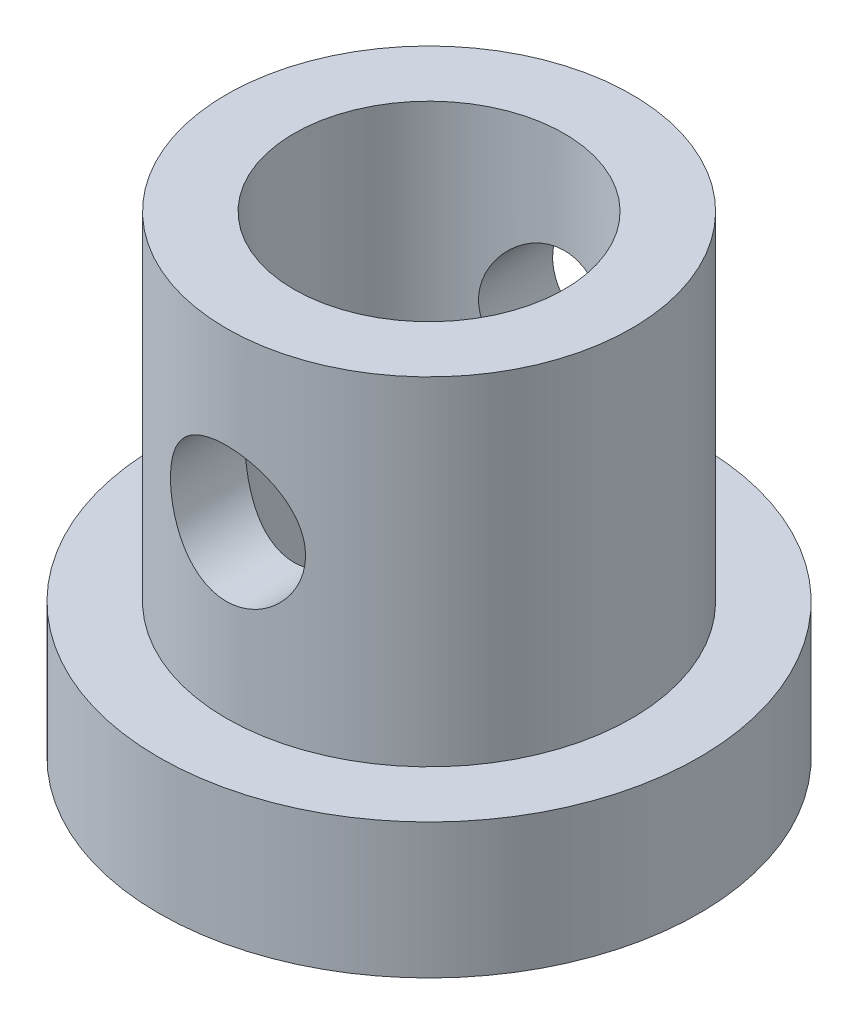
ISO-10303-21;
HEADER;
FILE_DESCRIPTION(('STEP AP214'),'2;1');
FILE_NAME('part.step','',(''),(''),'','','');
FILE_SCHEMA(('AUTOMOTIVE_DESIGN { 1 0 10303 214 1 1 1 1 }'));
ENDSEC;
DATA;
#1=APPLICATION_CONTEXT('core data for automotive mechanical design processes');
#2=APPLICATION_PROTOCOL_DEFINITION('international standard','automotive_design',2000,#1);
#3=PRODUCT_CONTEXT('',#1,'mechanical');
#4=PRODUCT('Part','Part','',(#3));
#5=PRODUCT_RELATED_PRODUCT_CATEGORY('part','',(#4));
#6=PRODUCT_DEFINITION_FORMATION('','',#4);
#7=PRODUCT_DEFINITION_CONTEXT('part definition',#1,'design');
#8=PRODUCT_DEFINITION('design','',#6,#7);
#9=PRODUCT_DEFINITION_SHAPE('','',#8);
#10=(LENGTH_UNIT() NAMED_UNIT(*) SI_UNIT(.MILLI.,.METRE.));
#11=(NAMED_UNIT(*) PLANE_ANGLE_UNIT() SI_UNIT($,.RADIAN.));
#12=(NAMED_UNIT(*) SI_UNIT($,.STERADIAN.) SOLID_ANGLE_UNIT());
#13=UNCERTAINTY_MEASURE_WITH_UNIT(LENGTH_MEASURE(1.E-05),#10,'distance_accuracy_value','');
#14=(GEOMETRIC_REPRESENTATION_CONTEXT(3) GLOBAL_UNCERTAINTY_ASSIGNED_CONTEXT((#13)) GLOBAL_UNIT_ASSIGNED_CONTEXT((#10,
#11,#12)) REPRESENTATION_CONTEXT('',''));
#15=CARTESIAN_POINT('',(0.,0.,0.));
#16=DIRECTION('',(0.,0.,1.));
#17=DIRECTION('',(1.,0.,0.));
#18=AXIS2_PLACEMENT_3D('',#15,#16,#17);
#19=CARTESIAN_POINT('',(0.,2.,0.));
#20=DIRECTION('',(0.,1.,0.));
#21=DIRECTION('',(0.,0.,1.));
#22=AXIS2_PLACEMENT_3D('',#19,#20,#21);
#23=PLANE('',#22);
#24=CARTESIAN_POINT('',(0.,2.,0.));
#25=DIRECTION('',(0.,1.,0.));
#26=DIRECTION('',(0.,0.,1.));
#27=AXIS2_PLACEMENT_3D('',#24,#25,#26);
#28=CIRCLE('',#27,4.);
#29=CARTESIAN_POINT('',(0.,2.,4.));
#30=VERTEX_POINT('',#29);
#31=EDGE_CURVE('E10',#30,#30,#28,.T.);
#32=ORIENTED_EDGE('',*,*,#31,.T.);
#33=EDGE_LOOP('',(#32));
#34=FACE_BOUND('',#33,.T.);
#35=CARTESIAN_POINT('',(0.,2.,0.));
#36=DIRECTION('',(0.,1.,0.));
#37=DIRECTION('',(0.,0.,1.));
#38=AXIS2_PLACEMENT_3D('',#35,#36,#37);
#39=CIRCLE('',#38,3.);
#40=CARTESIAN_POINT('',(0.,2.,3.));
#41=VERTEX_POINT('',#40);
#42=EDGE_CURVE('E104',#41,#41,#39,.T.);
#43=ORIENTED_EDGE('',*,*,#42,.F.);
#44=EDGE_LOOP('',(#43));
#45=FACE_BOUND('',#44,.T.);
#46=ADVANCED_FACE('F31',(#34,#45),#23,.T.);
#47=CARTESIAN_POINT('',(0.,0.,0.));
#48=DIRECTION('',(0.,1.,0.));
#49=DIRECTION('',(0.,0.,1.));
#50=AXIS2_PLACEMENT_3D('',#47,#48,#49);
#51=PLANE('',#50);
#52=CARTESIAN_POINT('',(0.,0.,0.));
#53=DIRECTION('',(0.,1.,0.));
#54=DIRECTION('',(0.,0.,1.));
#55=AXIS2_PLACEMENT_3D('',#52,#53,#54);
#56=CIRCLE('',#55,4.);
#57=CARTESIAN_POINT('',(0.,0.,4.));
#58=VERTEX_POINT('',#57);
#59=EDGE_CURVE('E44',#58,#58,#56,.T.);
#60=ORIENTED_EDGE('',*,*,#59,.F.);
#61=EDGE_LOOP('',(#60));
#62=FACE_BOUND('',#61,.T.);
#63=CARTESIAN_POINT('',(0.,0.,0.));
#64=DIRECTION('',(0.,1.,0.));
#65=DIRECTION('',(0.,0.,1.));
#66=AXIS2_PLACEMENT_3D('',#63,#64,#65);
#67=CIRCLE('',#66,2.);
#68=CARTESIAN_POINT('',(0.,0.,2.));
#69=VERTEX_POINT('',#68);
#70=EDGE_CURVE('E49',#69,#69,#67,.T.);
#71=ORIENTED_EDGE('',*,*,#70,.T.);
#72=EDGE_LOOP('',(#71));
#73=FACE_BOUND('',#72,.T.);
#74=ADVANCED_FACE('F90',(#62,#73),#51,.F.);
#75=CARTESIAN_POINT('',(0.,2.,0.));
#76=DIRECTION('',(0.,-1.,0.));
#77=DIRECTION('',(0.,0.,-1.));
#78=AXIS2_PLACEMENT_3D('',#75,#76,#77);
#79=CYLINDRICAL_SURFACE('',#78,4.);
#80=ORIENTED_EDGE('',*,*,#31,.F.);
#81=EDGE_LOOP('',(#80));
#82=FACE_BOUND('',#81,.T.);
#83=ORIENTED_EDGE('',*,*,#59,.T.);
#84=EDGE_LOOP('',(#83));
#85=FACE_BOUND('',#84,.T.);
#86=ADVANCED_FACE('F33',(#82,#85),#79,.T.);
#87=CARTESIAN_POINT('',(0.,2.,0.));
#88=DIRECTION('',(0.,-1.,0.));
#89=DIRECTION('',(0.,0.,-1.));
#90=AXIS2_PLACEMENT_3D('',#87,#88,#89);
#91=CYLINDRICAL_SURFACE('',#90,2.);
#92=CARTESIAN_POINT('',(0.,5.5,-2.));
#93=CARTESIAN_POINT('',(-0.0525719629529865,5.4999966976805,-1.99999713404151));
#94=CARTESIAN_POINT('',(-0.105206599698033,5.49582992687833,-1.99790491019518));
#95=CARTESIAN_POINT('',(-0.208920235268425,5.47934711965908,-1.98974156037396));
#96=CARTESIAN_POINT('',(-0.259996086713504,5.46701560700235,-1.98366287828984));
#97=CARTESIAN_POINT('',(-0.358933544880574,5.43480619138321,-1.96816279403312));
#98=CARTESIAN_POINT('',(-0.40680680293918,5.41495761575199,-1.9587543917752));
#99=CARTESIAN_POINT('',(-0.498472616806565,5.36842937863506,-1.93745776515779));
#100=CARTESIAN_POINT('',(-0.54226549399005,5.34175025575115,-1.9255697363353));
#101=CARTESIAN_POINT('',(-0.627507817761919,5.2804827505147,-1.89956258258057));
#102=CARTESIAN_POINT('',(-0.668655211122112,5.24551352076036,-1.88535199127536));
#103=CARTESIAN_POINT('',(-0.744779444866977,5.16947852075297,-1.85659970246744));
#104=CARTESIAN_POINT('',(-0.779751583106766,5.12840814822756,-1.84205776209035));
#105=CARTESIAN_POINT('',(-0.845252000450278,5.03751665047662,-1.81298951197347));
#106=CARTESIAN_POINT('',(-0.875225335551637,4.98726390165409,-1.79855186970132));
#107=CARTESIAN_POINT('',(-0.926168226890695,4.88163266401379,-1.77285978772321));
#108=CARTESIAN_POINT('',(-0.947144214966334,4.82625787127725,-1.7616030760699));
#109=CARTESIAN_POINT('',(-0.978132442188588,4.71533489457808,-1.74457867037809));
#110=CARTESIAN_POINT('',(-0.988725857080441,4.65999554793261,-1.73852271583714));
#111=CARTESIAN_POINT('',(-1.00042699330885,4.54802116222052,-1.73181889948528));
#112=CARTESIAN_POINT('',(-1.00154408837307,4.49138745912885,-1.73116569343288));
#113=CARTESIAN_POINT('',(-0.994687287172294,4.38571397568463,-1.73510930257248));
#114=CARTESIAN_POINT('',(-0.987784559536821,4.33657596877695,-1.73908763662014));
#115=CARTESIAN_POINT('',(-0.966939849056932,4.24027809062696,-1.7507622873385));
#116=CARTESIAN_POINT('',(-0.952995623897652,4.19311885469468,-1.75845978831776));
#117=CARTESIAN_POINT('',(-0.918209780386004,4.10077086743434,-1.77687476412741));
#118=CARTESIAN_POINT('',(-0.897215067115995,4.05565360121421,-1.78765840663999));
#119=CARTESIAN_POINT('',(-0.849041687668002,3.96936570740999,-1.81103404281404));
#120=CARTESIAN_POINT('',(-0.821860243812467,3.92819686439991,-1.82362684780191));
#121=CARTESIAN_POINT('',(-0.758066054912788,3.84547874725677,-1.85113157903286));
#122=CARTESIAN_POINT('',(-0.720694458369281,3.80454312642384,-1.86613510236746));
#123=CARTESIAN_POINT('',(-0.639555578741373,3.7292645814091,-1.89547623300407));
#124=CARTESIAN_POINT('',(-0.595785256574285,3.69492480796612,-1.90981351958801));
#125=CARTESIAN_POINT('',(-0.500516505831848,3.63231433897027,-1.93701987282964));
#126=CARTESIAN_POINT('',(-0.448753591599409,3.60439952755426,-1.94978984162007));
#127=CARTESIAN_POINT('',(-0.340466215488797,3.55790297095699,-1.97157881121242));
#128=CARTESIAN_POINT('',(-0.283945576265277,3.53931381498483,-1.98060078943553));
#129=CARTESIAN_POINT('',(-0.172766491660702,3.51352459628332,-1.99324333741436));
#130=CARTESIAN_POINT('',(-0.118341530548324,3.50550876425322,-1.99724938301312));
#131=CARTESIAN_POINT('',(-0.0087795999493535,3.49853526886551,-2.00073013459102));
#132=CARTESIAN_POINT('',(0.0463570198699014,3.49957331436052,-2.00020698721312));
#133=CARTESIAN_POINT('',(0.151232971985994,3.51020668841875,-1.99491192253441));
#134=CARTESIAN_POINT('',(0.201059408049954,3.51913253273003,-1.9904724568819));
#135=CARTESIAN_POINT('',(0.298406892301917,3.54423807189509,-1.97822171314819));
#136=CARTESIAN_POINT('',(0.345927685690997,3.56041856645336,-1.97041006334332));
#137=CARTESIAN_POINT('',(0.438888608449665,3.59999846643317,-1.95184251413669));
#138=CARTESIAN_POINT('',(0.484230397006154,3.62359105011681,-1.94100881769939));
#139=CARTESIAN_POINT('',(0.570461361698921,3.67710753564604,-1.91743974317109));
#140=CARTESIAN_POINT('',(0.611348629775282,3.70703413459343,-1.90470355565785));
#141=CARTESIAN_POINT('',(0.691767689290653,3.77576042533287,-1.87708221337464));
#142=CARTESIAN_POINT('',(0.730772077824639,3.81514286845357,-1.86210884848441));
#143=CARTESIAN_POINT('',(0.80185632111324,3.89992515126931,-1.83262391603874));
#144=CARTESIAN_POINT('',(0.833931385690841,3.94532911881638,-1.81811267381526));
#145=CARTESIAN_POINT('',(0.891707914497696,4.04364365420031,-1.79051192226068));
#146=CARTESIAN_POINT('',(0.917025495878637,4.09681126620859,-1.77752529663472));
#147=CARTESIAN_POINT('',(0.958082826013803,4.20751006769252,-1.75574072368126));
#148=CARTESIAN_POINT('',(0.97383491588757,4.26503552650119,-1.74693738240618));
#149=CARTESIAN_POINT('',(0.993861687449679,4.37691022286145,-1.73561501008667));
#150=CARTESIAN_POINT('',(0.999092996400865,4.43103425342904,-1.73257383460491));
#151=CARTESIAN_POINT('',(1.00068915438079,4.53944706717073,-1.73165354646175));
#152=CARTESIAN_POINT('',(0.997057846624399,4.59373576873943,-1.73377219627553));
#153=CARTESIAN_POINT('',(0.981926125592263,4.69548350153202,-1.74237862050025));
#154=CARTESIAN_POINT('',(0.9712083143428,4.7431004701444,-1.74843094482394));
#155=CARTESIAN_POINT('',(0.943175358224645,4.83580811942471,-1.76371016187917));
#156=CARTESIAN_POINT('',(0.92585809115981,4.88089798209197,-1.77293807569676));
#157=CARTESIAN_POINT('',(0.883815745300683,4.97062485098661,-1.79428530364528));
#158=CARTESIAN_POINT('',(0.858671137816457,5.0150279018297,-1.80655722396191));
#159=CARTESIAN_POINT('',(0.802150971636633,5.09927453618059,-1.8323533163459));
#160=CARTESIAN_POINT('',(0.770772171238647,5.13911573051849,-1.84587813794522));
#161=CARTESIAN_POINT('',(0.698203326664641,5.21814198235762,-1.87462323159313));
#162=CARTESIAN_POINT('',(0.656284423010171,5.25665910236192,-1.88984983311469));
#163=CARTESIAN_POINT('',(0.56615480622028,5.32626298342363,-1.91877752255088));
#164=CARTESIAN_POINT('',(0.517940723256785,5.35734573942629,-1.9324777860804));
#165=CARTESIAN_POINT('',(0.415931596819947,5.4112363627622,-1.95698009585103));
#166=CARTESIAN_POINT('',(0.362099503934615,5.43398416941144,-1.96776096562909));
#167=CARTESIAN_POINT('',(0.250742101294191,5.46980816791895,-1.98501341363465));
#168=CARTESIAN_POINT('',(0.193227799623166,5.48291184682958,-1.99149723372932));
#169=CARTESIAN_POINT('',(0.112601946483384,5.49389741107585,-1.99695461909663));
#170=CARTESIAN_POINT('',(0.0901618794394986,5.49618264086362,-1.99809365339202));
#171=CARTESIAN_POINT('',(0.0451517318071576,5.49923466551681,-1.99961696977865));
#172=CARTESIAN_POINT('',(0.0225816476473814,5.5000014184712,-2.00000123103763));
#173=CARTESIAN_POINT('',(0.,5.5,-2.));
#174=B_SPLINE_CURVE_WITH_KNOTS('',3,(#92,#93,#94,#95,#96,#97,#98,#99,#100,#101,#102,#103,#104,
#105,#106,#107,#108,#109,#110,#111,#112,#113,#114,#115,#116,#117,#118,#119,#120,#121,#122,#123,
#124,#125,#126,#127,#128,#129,#130,#131,#132,#133,#134,#135,#136,#137,#138,#139,#140,#141,#142,
#143,#144,#145,#146,#147,#148,#149,#150,#151,#152,#153,#154,#155,#156,#157,#158,#159,#160,#161,
#162,#163,#164,#165,#166,#167,#168,#169,#170,#171,#172,#173),.UNSPECIFIED.,.T.,.F.,(4,2,2,2,2,2,
2,2,2,2,2,2,2,2,2,2,2,2,2,2,2,2,2,2,2,2,2,2,2,2,2,2,2,2,2,2,2,2,2,2,4),(0.,0.157624257420293,
0.315548149709198,0.472862155492298,0.630163760581568,0.796981758718089,0.963926237654035,
1.14381726430753,1.32357947898281,1.49258012140229,1.6614135732902,1.81005712409321,
1.95874803925678,2.11090240168487,2.26312521260222,2.43464941333878,2.60625534598686,
2.78583022214441,2.9652621691228,3.12983290471346,3.29432564511476,3.44606906506122,
3.59782921630932,3.75392856027899,3.91009450748339,4.08159610644419,4.25321588615432,
4.43314682159674,4.61284511940778,4.77529307498373,4.93767059860005,5.08457930244183,
5.23153528783678,5.38836456775614,5.54527561138958,5.72125242752498,5.89732383376572,
6.07464013662925,6.2514490862493,6.31915280137697,6.38685838514847),.UNSPECIFIED.);
#175=CARTESIAN_POINT('',(0.,5.5,-2.));
#176=VERTEX_POINT('',#175);
#177=EDGE_CURVE('E78',#176,#176,#174,.T.);
#178=ORIENTED_EDGE('',*,*,#177,.F.);
#179=EDGE_LOOP('',(#178));
#180=FACE_BOUND('',#179,.T.);
#181=CARTESIAN_POINT('',(1.,4.5,1.73205080756888));
#182=CARTESIAN_POINT('',(0.999996363074532,4.44789219180475,1.73205534728459));
#183=CARTESIAN_POINT('',(0.995899970733217,4.39571858847496,1.73443801187756));
#184=CARTESIAN_POINT('',(0.979723209898053,4.29297273532285,1.74362366452052));
#185=CARTESIAN_POINT('',(0.967626064554179,4.24240408495659,1.75043594055559));
#186=CARTESIAN_POINT('',(0.936099948699812,4.14454833565606,1.76749346605398));
#187=CARTESIAN_POINT('',(0.916709952493731,4.09724534752641,1.77772043473252));
#188=CARTESIAN_POINT('',(0.871267525376372,4.00657579800328,1.80042664816858));
#189=CARTESIAN_POINT('',(0.845214734035774,3.96320944973754,1.81290601476065));
#190=CARTESIAN_POINT('',(0.784666540530879,3.87769427144249,1.83996869057441));
#191=CARTESIAN_POINT('',(0.74965203614377,3.83594086432646,1.85464063637954));
#192=CARTESIAN_POINT('',(0.673253807614468,3.75859161159329,1.88371982785706));
#193=CARTESIAN_POINT('',(0.631866925782293,3.72299883741648,1.8981269383125));
#194=CARTESIAN_POINT('',(0.540489563414546,3.65663284885234,1.92621476952949));
#195=CARTESIAN_POINT('',(0.490107189012575,3.62634623214047,1.93978106418172));
#196=CARTESIAN_POINT('',(0.384157026599505,3.57485914675424,1.96350756099529));
#197=CARTESIAN_POINT('',(0.328592538138156,3.55365294386283,1.97366991183742));
#198=CARTESIAN_POINT('',(0.218044943925978,3.5224953386989,1.98880461244237));
#199=CARTESIAN_POINT('',(0.163301790488818,3.51185047364447,1.99409480220892));
#200=CARTESIAN_POINT('',(0.0525706286978487,3.49983388132496,2.00007583846067));
#201=CARTESIAN_POINT('',(-0.00341660584373794,3.49845654320429,2.0007694678459));
#202=CARTESIAN_POINT('',(-0.109832524423749,3.50474667397035,1.9976298191645));
#203=CARTESIAN_POINT('',(-0.160321199176791,3.51163801552122,1.9941849589216));
#204=CARTESIAN_POINT('',(-0.259313771918321,3.53288084390466,1.98374245259747));
#205=CARTESIAN_POINT('',(-0.307817521093925,3.54723288897622,1.97674454066394));
#206=CARTESIAN_POINT('',(-0.402309391569553,3.58308256608981,1.95971583287654));
#207=CARTESIAN_POINT('',(-0.448253423515178,3.60467631317207,1.94964441529199));
#208=CARTESIAN_POINT('',(-0.535976801513328,3.65426341620149,1.92737645986687));
#209=CARTESIAN_POINT('',(-0.577754648838645,3.68225906330235,1.91517916157484));
#210=CARTESIAN_POINT('',(-0.660173660898194,3.74689535153302,1.88844394399229));
#211=CARTESIAN_POINT('',(-0.70033407502936,3.78410302832601,1.87379375998175));
#212=CARTESIAN_POINT('',(-0.77410437029778,3.86458972493018,1.84454340586812));
#213=CARTESIAN_POINT('',(-0.80770921157423,3.90787337227406,1.82994328265629));
#214=CARTESIAN_POINT('',(-0.869505334642211,4.00264819242409,1.80144156092485));
#215=CARTESIAN_POINT('',(-0.897217314978051,4.05448602305421,1.78764319990708));
#216=CARTESIAN_POINT('',(-0.943319113001231,4.162937671359,1.76375450278576));
#217=CARTESIAN_POINT('',(-0.961718658210889,4.21954643301756,1.75366030046067));
#218=CARTESIAN_POINT('',(-0.98718021102504,4.33121451128279,1.73944635817034));
#219=CARTESIAN_POINT('',(-0.995025122119976,4.38604111904355,1.73491655848496));
#220=CARTESIAN_POINT('',(-1.00151694661143,4.49640134151654,1.7311791936161));
#221=CARTESIAN_POINT('',(-1.00017035731503,4.55193442911979,1.73196786889312));
#222=CARTESIAN_POINT('',(-0.989036043343966,4.65565391857873,1.73834336540585));
#223=CARTESIAN_POINT('',(-0.980187816712467,4.70397945110793,1.74339587506654));
#224=CARTESIAN_POINT('',(-0.955696284632441,4.79836778627096,1.75694021551341));
#225=CARTESIAN_POINT('',(-0.940050778623615,4.84442985074661,1.76543316005034));
#226=CARTESIAN_POINT('',(-0.901647588604886,4.9354113309027,1.78536222079657));
#227=CARTESIAN_POINT('',(-0.878594063692724,4.98017901685355,1.79691643243063));
#228=CARTESIAN_POINT('',(-0.826287064015805,5.06546927153899,1.8215611949725));
#229=CARTESIAN_POINT('',(-0.797030404332217,5.10598964351328,1.83465253355148));
#230=CARTESIAN_POINT('',(-0.728837167198854,5.18697876752355,1.86287998456336));
#231=CARTESIAN_POINT('',(-0.689145272314967,5.22679715071766,1.87806583154289));
#232=CARTESIAN_POINT('',(-0.603404495398289,5.29941223799359,1.90734234977892));
#233=CARTESIAN_POINT('',(-0.557353474655348,5.33220657023054,1.92143265007709));
#234=CARTESIAN_POINT('',(-0.458535362558758,5.3905737259501,1.94741361690957));
#235=CARTESIAN_POINT('',(-0.405623097574114,5.41593311821091,1.95923641672029));
#236=CARTESIAN_POINT('',(-0.295522364641082,5.45713790385739,1.97883354959301));
#237=CARTESIAN_POINT('',(-0.238337701392176,5.47299165136631,1.98661143676373));
#238=CARTESIAN_POINT('',(-0.126979682330418,5.49336856417466,1.99667508181883));
#239=CARTESIAN_POINT('',(-0.0730114438504576,5.49879787587611,1.99939927908191));
#240=CARTESIAN_POINT('',(0.035125985951203,5.5008432654544,2.00042130375131));
#241=CARTESIAN_POINT('',(0.0892951002950863,5.49746242852356,1.9987206806689));
#242=CARTESIAN_POINT('',(0.192537992317147,5.48258359320438,1.99133968837923));
#243=CARTESIAN_POINT('',(0.241712317811263,5.47163515074233,1.9859289466799));
#244=CARTESIAN_POINT('',(0.337445952183617,5.44267300069703,1.97192093663423));
#245=CARTESIAN_POINT('',(0.384004884955508,5.42465827990655,1.96332321132796));
#246=CARTESIAN_POINT('',(0.475423406244884,5.38127294783403,1.9432593074812));
#247=CARTESIAN_POINT('',(0.520125142700045,5.35562067679216,1.93168617198799));
#248=CARTESIAN_POINT('',(0.604774641814024,5.29804206914095,1.90688133141826));
#249=CARTESIAN_POINT('',(0.644720207414906,5.26611285088433,1.89364886558361));
#250=CARTESIAN_POINT('',(0.722914004156891,5.1932028609773,1.86528610226628));
#251=CARTESIAN_POINT('',(0.760597684539271,5.15163751252281,1.85009799011698));
#252=CARTESIAN_POINT('',(0.828663287394674,5.06254927887023,1.82063076162852));
#253=CARTESIAN_POINT('',(0.859038750010058,5.01502117913232,1.80635245761865));
#254=CARTESIAN_POINT('',(0.912431079785654,4.91336335341905,1.77999605304916));
#255=CARTESIAN_POINT('',(0.935185065960939,4.85907246887127,1.7680017425627));
#256=CARTESIAN_POINT('',(0.970878709506411,4.74666759566022,1.74866156328352));
#257=CARTESIAN_POINT('',(0.983851191175346,4.68856711108732,1.74130016147702));
#258=CARTESIAN_POINT('',(0.994367007864415,4.60819464434801,1.7352927260179));
#259=CARTESIAN_POINT('',(0.996476104963851,4.58663210560212,1.73408129005152));
#260=CARTESIAN_POINT('',(0.999293405089963,4.54338351931776,1.7324593588775));
#261=CARTESIAN_POINT('',(1.00000151439987,4.52169746361413,1.73204891725109));
#262=CARTESIAN_POINT('',(1.,4.5,1.73205080756888));
#263=B_SPLINE_CURVE_WITH_KNOTS('',3,(#181,#182,#183,#184,#185,#186,#187,#188,#189,#190,#191,
#192,#193,#194,#195,#196,#197,#198,#199,#200,#201,#202,#203,#204,#205,#206,#207,#208,#209,#210,
#211,#212,#213,#214,#215,#216,#217,#218,#219,#220,#221,#222,#223,#224,#225,#226,#227,#228,#229,
#230,#231,#232,#233,#234,#235,#236,#237,#238,#239,#240,#241,#242,#243,#244,#245,#246,#247,#248,
#249,#250,#251,#252,#253,#254,#255,#256,#257,#258,#259,#260,#261,#262),.UNSPECIFIED.,.T.,.F.,(4,
2,2,2,2,2,2,2,2,2,2,2,2,2,2,2,2,2,2,2,2,2,2,2,2,2,2,2,2,2,2,2,2,2,2,2,2,2,2,2,4),(0.,
0.156232122594716,0.312792892824805,0.468528595918885,0.624272725445149,0.792862312498234,
0.96153571084371,1.14157892238763,1.32150826963891,1.48863484967935,1.6556602368604,
1.80816097484538,1.96067312517455,2.11529534731147,2.26997299350272,2.43927191456891,
2.60870048245919,2.78888841729448,2.96888774211705,3.13462290854212,3.30024093188373,
3.44774183424025,3.59529052436063,3.74967296406088,3.90413486220047,4.07806743580613,
4.25205864978202,4.43064181412966,4.60906779808772,4.77112270389487,4.93312086793972,
5.08444424871493,5.23578933512013,5.39360750719472,5.55149830100719,5.72510241850067,
5.89885942845154,6.07810749038605,6.2567513300276,6.32180135185309,6.38685572494541),.UNSPECIFIED.);
#264=CARTESIAN_POINT('',(1.,4.5,1.73205080756888));
#265=VERTEX_POINT('',#264);
#266=EDGE_CURVE('E73',#265,#265,#263,.T.);
#267=ORIENTED_EDGE('',*,*,#266,.F.);
#268=EDGE_LOOP('',(#267));
#269=FACE_BOUND('',#268,.T.);
#270=ORIENTED_EDGE('',*,*,#70,.F.);
#271=EDGE_LOOP('',(#270));
#272=FACE_BOUND('',#271,.T.);
#273=CARTESIAN_POINT('',(0.,7.,0.));
#274=DIRECTION('',(0.,1.,0.));
#275=DIRECTION('',(0.,0.,1.));
#276=AXIS2_PLACEMENT_3D('',#273,#274,#275);
#277=CIRCLE('',#276,2.);
#278=CARTESIAN_POINT('',(0.,7.,2.));
#279=VERTEX_POINT('',#278);
#280=EDGE_CURVE('E109',#279,#279,#277,.T.);
#281=ORIENTED_EDGE('',*,*,#280,.T.);
#282=EDGE_LOOP('',(#281));
#283=FACE_BOUND('',#282,.T.);
#284=ADVANCED_FACE('F83',(#180,#269,#272,#283),#91,.F.);
#285=CARTESIAN_POINT('',(0.,7.,0.));
#286=DIRECTION('',(0.,1.,0.));
#287=DIRECTION('',(0.,0.,1.));
#288=AXIS2_PLACEMENT_3D('',#285,#286,#287);
#289=PLANE('',#288);
#290=CARTESIAN_POINT('',(0.,7.,0.));
#291=DIRECTION('',(0.,1.,0.));
#292=DIRECTION('',(0.,0.,1.));
#293=AXIS2_PLACEMENT_3D('',#290,#291,#292);
#294=CIRCLE('',#293,3.);
#295=CARTESIAN_POINT('',(0.,7.,3.));
#296=VERTEX_POINT('',#295);
#297=EDGE_CURVE('E102',#296,#296,#294,.T.);
#298=ORIENTED_EDGE('',*,*,#297,.T.);
#299=EDGE_LOOP('',(#298));
#300=FACE_BOUND('',#299,.T.);
#301=ORIENTED_EDGE('',*,*,#280,.F.);
#302=EDGE_LOOP('',(#301));
#303=FACE_BOUND('',#302,.T.);
#304=ADVANCED_FACE('F67',(#300,#303),#289,.T.);
#305=CARTESIAN_POINT('',(0.,7.,0.));
#306=DIRECTION('',(0.,-1.,0.));
#307=DIRECTION('',(0.,0.,-1.));
#308=AXIS2_PLACEMENT_3D('',#305,#306,#307);
#309=CYLINDRICAL_SURFACE('',#308,3.);
#310=CARTESIAN_POINT('',(0.,5.5,-3.));
#311=CARTESIAN_POINT('',(-0.0545633628867233,5.50000025373164,-3.00000015300943));
#312=CARTESIAN_POINT('',(-0.10912519453855,5.49551973387278,-2.99849769507545));
#313=CARTESIAN_POINT('',(-0.216641760872972,5.47777089118278,-2.99265210203281));
#314=CARTESIAN_POINT('',(-0.269596328118818,5.46450165605108,-2.98830867202153));
#315=CARTESIAN_POINT('',(-0.372332789501776,5.42968075661595,-2.97725307906443));
#316=CARTESIAN_POINT('',(-0.422119825886034,5.40814293754073,-2.97054487730853));
#317=CARTESIAN_POINT('',(-0.517374936805324,5.35745882716165,-2.95544445717342));
#318=CARTESIAN_POINT('',(-0.562842156958706,5.3283110349974,-2.94705190667778));
#319=CARTESIAN_POINT('',(-0.649741675022266,5.26217419514125,-2.92914094443005));
#320=CARTESIAN_POINT('',(-0.691003700298309,5.22496876573951,-2.91959556463785));
#321=CARTESIAN_POINT('',(-0.766832692702083,5.14423284529344,-2.90060314783122));
#322=CARTESIAN_POINT('',(-0.801398185489462,5.10070096507149,-2.89115613290549));
#323=CARTESIAN_POINT('',(-0.863824942227859,5.00701488480354,-2.87313332477274));
#324=CARTESIAN_POINT('',(-0.891464858221032,4.95670626026788,-2.86459039275688));
#325=CARTESIAN_POINT('',(-0.937818873877721,4.85182390554145,-2.84975305418601));
#326=CARTESIAN_POINT('',(-0.956535697386765,4.79725148283726,-2.84345796160746));
#327=CARTESIAN_POINT('',(-0.983873461509163,4.68732677850329,-2.83411303269377));
#328=CARTESIAN_POINT('',(-0.992813448271769,4.63206279151094,-2.83096095769611));
#329=CARTESIAN_POINT('',(-1.00134112333448,4.52073624584412,-2.82795656629508));
#330=CARTESIAN_POINT('',(-1.00093170160472,4.46467393929081,-2.8281032302273));
#331=CARTESIAN_POINT('',(-0.991019903703419,4.35606336955598,-2.8315901500818));
#332=CARTESIAN_POINT('',(-0.981933913166995,4.30347159708098,-2.83478415867533));
#333=CARTESIAN_POINT('',(-0.955606162849417,4.20060658039317,-2.84376657724551));
#334=CARTESIAN_POINT('',(-0.938363426591871,4.15033361456493,-2.84955529784108));
#335=CARTESIAN_POINT('',(-0.895939058060211,4.05258725040852,-2.86317911131249));
#336=CARTESIAN_POINT('',(-0.870634048707263,4.00517197453047,-2.87104565793117));
#337=CARTESIAN_POINT('',(-0.812889106303139,3.91512909172027,-2.88792558575726));
#338=CARTESIAN_POINT('',(-0.780447112364005,3.87250287306662,-2.89693929790464));
#339=CARTESIAN_POINT('',(-0.707349332682237,3.79090840183923,-2.91567329167741));
#340=CARTESIAN_POINT('',(-0.666353150076311,3.75224730549093,-2.92540589354843));
#341=CARTESIAN_POINT('',(-0.578339569970064,3.6822687333366,-2.94406938387037));
#342=CARTESIAN_POINT('',(-0.531321595660815,3.6509519618355,-2.95300019538067));
#343=CARTESIAN_POINT('',(-0.431947613046268,3.59630369976493,-2.96917107937794));
#344=CARTESIAN_POINT('',(-0.379543276416337,3.57305450865927,-2.97639350008039));
#345=CARTESIAN_POINT('',(-0.271269083364508,3.53579682604429,-2.98820567144435));
#346=CARTESIAN_POINT('',(-0.215400438154954,3.52178512457656,-2.99279633654879));
#347=CARTESIAN_POINT('',(-0.104383829529304,3.50394433397764,-2.99867627071441));
#348=CARTESIAN_POINT('',(-0.0493095998648455,3.49970019082725,-3.00010001833731));
#349=CARTESIAN_POINT('',(0.0607750699602361,3.50033267359847,-2.99988902694825));
#350=CARTESIAN_POINT('',(0.115785519319647,3.50520775997987,-2.99825480419352));
#351=CARTESIAN_POINT('',(0.222519866304259,3.52361190773597,-2.99220024717114));
#352=CARTESIAN_POINT('',(0.274292806834856,3.53688620604952,-2.98786198711228));
#353=CARTESIAN_POINT('',(0.374855958579561,3.5713934444667,-2.97691846830034));
#354=CARTESIAN_POINT('',(0.423645788508559,3.59262739946768,-2.97031292046541));
#355=CARTESIAN_POINT('',(0.518288296393321,3.6430704318409,-2.95528931287427));
#356=CARTESIAN_POINT('',(0.564029959217329,3.6724745932836,-2.94682814756305));
#357=CARTESIAN_POINT('',(0.650064830135403,3.73819415001305,-2.92905253915743));
#358=CARTESIAN_POINT('',(0.690356367794894,3.77451165603016,-2.91973783591888));
#359=CARTESIAN_POINT('',(0.766252507807013,3.85497875100826,-2.90076847982472));
#360=CARTESIAN_POINT('',(0.801560969248491,3.89940922693325,-2.89111761095155));
#361=CARTESIAN_POINT('',(0.864257522320854,3.9937715678045,-2.87299973286981));
#362=CARTESIAN_POINT('',(0.891645547920843,4.0437034786102,-2.8645327335312));
#363=CARTESIAN_POINT('',(0.937596930423361,4.1476730153066,-2.84982391820308));
#364=CARTESIAN_POINT('',(0.956178132197766,4.20170207924278,-2.84357760900632));
#365=CARTESIAN_POINT('',(0.983894666792163,4.31237865012415,-2.83410832399133));
#366=CARTESIAN_POINT('',(0.993034254961243,4.36902496543306,-2.83088398622698));
#367=CARTESIAN_POINT('',(1.00127628247038,4.48019709601321,-2.82797858875071));
#368=CARTESIAN_POINT('',(1.00087025731093,4.53468234025174,-2.82812400344299));
#369=CARTESIAN_POINT('',(0.991242293454878,4.64276507489974,-2.8315126992356));
#370=CARTESIAN_POINT('',(0.982020879458887,4.69636261795291,-2.83475579595884));
#371=CARTESIAN_POINT('',(0.95537181312698,4.80013566301267,-2.84384524278943));
#372=CARTESIAN_POINT('',(0.93810334601488,4.85035682500723,-2.84964098015514));
#373=CARTESIAN_POINT('',(0.895979365760382,4.94722740693553,-2.86316398825434));
#374=CARTESIAN_POINT('',(0.871122168553979,4.99387603118726,-2.87089168765297));
#375=CARTESIAN_POINT('',(0.813260692583249,5.08448366992369,-2.8878282922406));
#376=CARTESIAN_POINT('',(0.779948242764532,5.12823650189859,-2.89708711641604));
#377=CARTESIAN_POINT('',(0.706642883135697,5.20968981338399,-2.91583356283786));
#378=CARTESIAN_POINT('',(0.666648084451495,5.24738857568802,-2.92532124912518));
#379=CARTESIAN_POINT('',(0.579241556920674,5.31714441228924,-2.94390030525393));
#380=CARTESIAN_POINT('',(0.531601513499725,5.34892434775102,-2.95296181801216));
#381=CARTESIAN_POINT('',(0.431357357406629,5.40399042885063,-2.96925991172652));
#382=CARTESIAN_POINT('',(0.37875451813235,5.42727874592204,-2.9764969590794));
#383=CARTESIAN_POINT('',(0.272493647200975,5.46372163248868,-2.98805515068532));
#384=CARTESIAN_POINT('',(0.218987757676408,5.47728246626338,-2.9924921242252));
#385=CARTESIAN_POINT('',(0.110320416010247,5.49542028067713,-2.99846407064225));
#386=CARTESIAN_POINT('',(0.0551594255687465,5.49999974349654,-2.99999984531906));
#387=CARTESIAN_POINT('',(0.,5.5,-3.));
#388=B_SPLINE_CURVE_WITH_KNOTS('',3,(#310,#311,#312,#313,#314,#315,#316,#317,#318,#319,#320,
#321,#322,#323,#324,#325,#326,#327,#328,#329,#330,#331,#332,#333,#334,#335,#336,#337,#338,#339,
#340,#341,#342,#343,#344,#345,#346,#347,#348,#349,#350,#351,#352,#353,#354,#355,#356,#357,#358,
#359,#360,#361,#362,#363,#364,#365,#366,#367,#368,#369,#370,#371,#372,#373,#374,#375,#376,#377,
#378,#379,#380,#381,#382,#383,#384,#385,#386,#387),.UNSPECIFIED.,.T.,.F.,(4,2,2,2,2,2,2,2,2,2,2,
2,2,2,2,2,2,2,2,2,2,2,2,2,2,2,2,2,2,2,2,2,2,2,2,2,2,2,4),(0.,0.163487106026011,
0.326991185267521,0.490222672870274,0.6534863777991,0.821846842827559,0.990244332875302,
1.1634838482347,1.33667044692833,1.5040192574184,1.67131633987485,1.8309682655128,
1.99063930855482,2.15288171155131,2.31517102558207,2.48593305811367,2.65671145966618,
2.82918405650358,3.00159668877208,3.1665358317517,3.33144713164177,3.49158157978213,
3.65173645284104,3.81610399843736,3.98052180821891,4.15241022880752,4.32430008234997,
4.49584013824417,4.66730284700846,4.82995666056619,4.99260079341185,5.15215587070228,
5.31174638165788,5.47830066681615,5.64490211113589,5.8179966082491,5.99104681142266,
6.15636558363624,6.3216386602795),.UNSPECIFIED.);
#389=CARTESIAN_POINT('',(0.,5.5,-3.));
#390=VERTEX_POINT('',#389);
#391=EDGE_CURVE('E35',#390,#390,#388,.T.);
#392=ORIENTED_EDGE('',*,*,#391,.T.);
#393=EDGE_LOOP('',(#392));
#394=FACE_BOUND('',#393,.T.);
#395=CARTESIAN_POINT('',(1.,4.5,2.82842712474619));
#396=CARTESIAN_POINT('',(1.0000002579478,4.44553182518932,2.82842694532735));
#397=CARTESIAN_POINT('',(0.99553478369814,4.39106520022848,2.83001769372806));
#398=CARTESIAN_POINT('',(0.977851131702564,4.28374557904939,2.8361757417458));
#399=CARTESIAN_POINT('',(0.964631512170673,4.23089285013606,2.8407435316722));
#400=CARTESIAN_POINT('',(0.929955485680263,4.12837310698719,2.85228203663888));
#401=CARTESIAN_POINT('',(0.908515221402,4.07870007055312,2.8592480396464));
#402=CARTESIAN_POINT('',(0.858061628442627,3.98363995145621,2.87479122017008));
#403=CARTESIAN_POINT('',(0.829046628860523,3.9382538174475,2.88336875305432));
#404=CARTESIAN_POINT('',(0.763051146442527,3.85128003766051,2.90154489405589));
#405=CARTESIAN_POINT('',(0.725824341377825,3.80988457132796,2.91116894844139));
#406=CARTESIAN_POINT('',(0.64498766721449,3.73379319877568,2.93013864801508));
#407=CARTESIAN_POINT('',(0.601376775052402,3.69909836841772,2.93948424829099));
#408=CARTESIAN_POINT('',(0.507604507964985,3.63652110267032,2.95713866921658));
#409=CARTESIAN_POINT('',(0.457301911224519,3.60884002938202,2.96541407701568));
#410=CARTESIAN_POINT('',(0.352431222987482,3.56240841487251,2.9796958677102));
#411=CARTESIAN_POINT('',(0.297864285687215,3.5436554668231,2.98570286203012));
#412=CARTESIAN_POINT('',(0.188028817433493,3.5162641453676,2.99459075431897));
#413=CARTESIAN_POINT('',(0.132850754852968,3.50729655374299,2.99757314777558));
#414=CARTESIAN_POINT('',(0.0216978748240916,3.49868370663934,3.00043608218249));
#415=CARTESIAN_POINT('',(-0.0342767335438922,3.49903604834758,3.00031742262891));
#416=CARTESIAN_POINT('',(-0.143103515193817,3.50884425456603,2.99706039618736));
#417=CARTESIAN_POINT('',(-0.195992048591666,3.51794252847451,2.99404064755135));
#418=CARTESIAN_POINT('',(-0.29944343882216,3.54439298098045,2.98546967339714));
#419=CARTESIAN_POINT('',(-0.350006137779175,3.56174571897976,2.97991827631115));
#420=CARTESIAN_POINT('',(-0.448152474842013,3.60442131730613,2.96675670293292));
#421=CARTESIAN_POINT('',(-0.495688220968997,3.62984593854678,2.9591204252427));
#422=CARTESIAN_POINT('',(-0.585924325527169,3.68785970544839,2.94258393038665));
#423=CARTESIAN_POINT('',(-0.628623334384769,3.72045084332664,2.93368336200518));
#424=CARTESIAN_POINT('',(-0.710100866551906,3.79367439346074,2.9150619185089));
#425=CARTESIAN_POINT('',(-0.748600157067555,3.83461315784544,2.90532215172667));
#426=CARTESIAN_POINT('',(-0.818277259595889,3.92244872572266,2.88647335245111));
#427=CARTESIAN_POINT('',(-0.849453943273005,3.96934644571324,2.8773644173145));
#428=CARTESIAN_POINT('',(-0.903987455042732,4.06865362561542,2.86070525135531));
#429=CARTESIAN_POINT('',(-0.927226463651049,4.12113213136781,2.85317909338821));
#430=CARTESIAN_POINT('',(-0.964443193299506,4.22957139426626,2.84081650878299));
#431=CARTESIAN_POINT('',(-0.978424795755529,4.28553068122182,2.83597895501223));
#432=CARTESIAN_POINT('',(-0.996161282090474,4.39663835540062,2.8297963630207));
#433=CARTESIAN_POINT('',(-1.00034909550575,4.45170942474572,2.82830360315139));
#434=CARTESIAN_POINT('',(-0.999605438911605,4.56177614911704,2.828566720628));
#435=CARTESIAN_POINT('',(-0.99467562522726,4.61677181602476,2.83032200792768));
#436=CARTESIAN_POINT('',(-0.97622565155183,4.72315696571116,2.83673618089379));
#437=CARTESIAN_POINT('',(-0.963006393980555,4.77460543015064,2.84129325440593));
#438=CARTESIAN_POINT('',(-0.928713862560596,4.87454360623938,2.8526855367127));
#439=CARTESIAN_POINT('',(-0.907639196363457,4.92303279159083,2.85952114934907));
#440=CARTESIAN_POINT('',(-0.857474340738901,5.01738042084694,2.87496877595718));
#441=CARTESIAN_POINT('',(-0.828151118358488,5.06310664264179,2.8836302566561));
#442=CARTESIAN_POINT('',(-0.762585630557568,5.14914605238373,2.90165768730984));
#443=CARTESIAN_POINT('',(-0.726341325498785,5.18945763866122,2.91102384443799));
#444=CARTESIAN_POINT('',(-0.645891705900323,5.26552798409063,2.92995038637844));
#445=CARTESIAN_POINT('',(-0.601387270546652,5.30097439001885,2.93949843577895));
#446=CARTESIAN_POINT('',(-0.506827291400258,5.36391614234804,2.9572685161311));
#447=CARTESIAN_POINT('',(-0.456771944864553,5.39141177116243,2.96549059417695));
#448=CARTESIAN_POINT('',(-0.352779862432296,5.43742010486172,2.97964405810603));
#449=CARTESIAN_POINT('',(-0.298871123321197,5.45599127714807,2.98559030004531));
#450=CARTESIAN_POINT('',(-0.188458465846017,5.4837277420601,2.99458610837774));
#451=CARTESIAN_POINT('',(-0.13195549195389,5.4928964298805,2.99763672034018));
#452=CARTESIAN_POINT('',(-0.0208153358600417,5.50126207760564,3.00041863236257));
#453=CARTESIAN_POINT('',(0.0337847239200181,5.50090745393238,3.00029920089441));
#454=CARTESIAN_POINT('',(0.142111145000172,5.49134269185359,2.99712196519396));
#455=CARTESIAN_POINT('',(0.195837576819054,5.48213327184724,2.99406439933567));
#456=CARTESIAN_POINT('',(0.300042119432059,5.45541776542403,2.98540914954421));
#457=CARTESIAN_POINT('',(0.350558270912794,5.43804578464705,2.9798525836118));
#458=CARTESIAN_POINT('',(0.447978350939788,5.39562246890287,2.96677160704464));
#459=CARTESIAN_POINT('',(0.494881624142408,5.37056974480306,2.95924684047901));
#460=CARTESIAN_POINT('',(0.585634016308808,5.31243048789792,2.94265868828001));
#461=CARTESIAN_POINT('',(0.629306251557696,5.27908131461808,2.93354872492381));
#462=CARTESIAN_POINT('',(0.710581026272338,5.20574260884409,2.91492988791425));
#463=CARTESIAN_POINT('',(0.748181621624259,5.16575095773832,2.90542088771397));
#464=CARTESIAN_POINT('',(0.817741808833464,5.07839064441197,2.88663279827365));
#465=CARTESIAN_POINT('',(0.849422965999216,5.03079448901923,2.87737727995345));
#466=CARTESIAN_POINT('',(0.904314343299799,4.93066557310135,2.86060193316303));
#467=CARTESIAN_POINT('',(0.927526776814559,4.87813410698576,2.8530816513617));
#468=CARTESIAN_POINT('',(0.963843828206626,4.77203817597617,2.84101334230535));
#469=CARTESIAN_POINT('',(0.977357909163268,4.71862773643428,2.83634632944799));
#470=CARTESIAN_POINT('',(0.995434320161694,4.61014394948453,2.8300538361394));
#471=CARTESIAN_POINT('',(0.999999739196501,4.55507118256425,2.82842730615135));
#472=CARTESIAN_POINT('',(1.,4.5,2.82842712474619));
#473=B_SPLINE_CURVE_WITH_KNOTS('',3,(#395,#396,#397,#398,#399,#400,#401,#402,#403,#404,#405,
#406,#407,#408,#409,#410,#411,#412,#413,#414,#415,#416,#417,#418,#419,#420,#421,#422,#423,#424,
#425,#426,#427,#428,#429,#430,#431,#432,#433,#434,#435,#436,#437,#438,#439,#440,#441,#442,#443,
#444,#445,#446,#447,#448,#449,#450,#451,#452,#453,#454,#455,#456,#457,#458,#459,#460,#461,#462,
#463,#464,#465,#466,#467,#468,#469,#470,#471,#472),.UNSPECIFIED.,.T.,.F.,(4,2,2,2,2,2,2,2,2,2,2,
2,2,2,2,2,2,2,2,2,2,2,2,2,2,2,2,2,2,2,2,2,2,2,2,2,2,2,4),(0.,0.163200584775416,0.32642805496888,
0.489336627454544,0.652281166139158,0.821013374229397,0.989772651673595,1.16293506139029,
1.33605076382161,1.50314318760306,1.67019253297699,1.83069004820941,1.99119844184608,
2.15381654855707,2.31647991869393,2.48680174359289,2.65714979607477,2.82992639837376,
3.00263051349688,3.16754291357512,3.33242535830306,3.49164395761849,3.65089079140018,
3.81518857728788,3.979534856552,4.15178808164165,4.32403518750605,4.49513791183924,
4.66617882997229,4.82918084670708,4.99216964002854,5.15256956033502,5.31299850756315,
5.47935519513706,5.64576504425704,5.81868902729217,5.99156778259939,6.15663212153685,
6.32163947179229),.UNSPECIFIED.);
#474=CARTESIAN_POINT('',(1.,4.5,2.82842712474619));
#475=VERTEX_POINT('',#474);
#476=EDGE_CURVE('E53',#475,#475,#473,.T.);
#477=ORIENTED_EDGE('',*,*,#476,.T.);
#478=EDGE_LOOP('',(#477));
#479=FACE_BOUND('',#478,.T.);
#480=ORIENTED_EDGE('',*,*,#297,.F.);
#481=EDGE_LOOP('',(#480));
#482=FACE_BOUND('',#481,.T.);
#483=ORIENTED_EDGE('',*,*,#42,.T.);
#484=EDGE_LOOP('',(#483));
#485=FACE_BOUND('',#484,.T.);
#486=ADVANCED_FACE('F58',(#394,#479,#482,#485),#309,.T.);
#487=CARTESIAN_POINT('',(0.,4.5,-12.5));
#488=DIRECTION('',(0.,0.,1.));
#489=DIRECTION('',(1.,0.,0.));
#490=AXIS2_PLACEMENT_3D('',#487,#488,#489);
#491=CYLINDRICAL_SURFACE('',#490,1.);
#492=ORIENTED_EDGE('',*,*,#266,.T.);
#493=EDGE_LOOP('',(#492));
#494=FACE_BOUND('',#493,.T.);
#495=ORIENTED_EDGE('',*,*,#476,.F.);
#496=EDGE_LOOP('',(#495));
#497=FACE_BOUND('',#496,.T.);
#498=ADVANCED_FACE('F65',(#494,#497),#491,.F.);
#499=ORIENTED_EDGE('',*,*,#177,.T.);
#500=EDGE_LOOP('',(#499));
#501=FACE_BOUND('',#500,.T.);
#502=ORIENTED_EDGE('',*,*,#391,.F.);
#503=EDGE_LOOP('',(#502));
#504=FACE_BOUND('',#503,.T.);
#505=ADVANCED_FACE('F62',(#501,#504),#491,.F.);
#506=CLOSED_SHELL('',(#46,#74,#86,#284,#304,#486,#498,#505));
#507=MANIFOLD_SOLID_BREP('B2',#506);
#508=ADVANCED_BREP_SHAPE_REPRESENTATION('',(#18,#507),#14);
#509=SHAPE_DEFINITION_REPRESENTATION(#9,#508);
ENDSEC;
END-ISO-10303-21;
